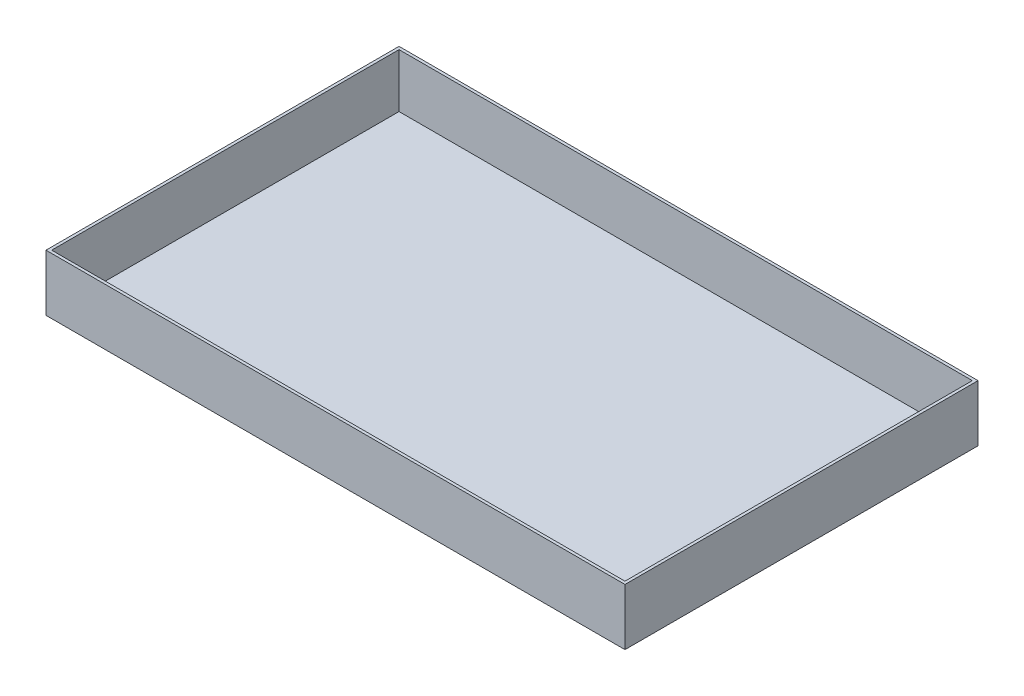
ISO-10303-21;
HEADER;
FILE_DESCRIPTION(('STEP AP214'),'2;1');
FILE_NAME('part.step','',(''),(''),'','','');
FILE_SCHEMA(('AUTOMOTIVE_DESIGN { 1 0 10303 214 1 1 1 1 }'));
ENDSEC;
DATA;
#1=APPLICATION_CONTEXT('core data for automotive mechanical design processes');
#2=APPLICATION_PROTOCOL_DEFINITION('international standard','automotive_design',2000,#1);
#3=PRODUCT_CONTEXT('',#1,'mechanical');
#4=PRODUCT('Part','Part','',(#3));
#5=PRODUCT_RELATED_PRODUCT_CATEGORY('part','',(#4));
#6=PRODUCT_DEFINITION_FORMATION('','',#4);
#7=PRODUCT_DEFINITION_CONTEXT('part definition',#1,'design');
#8=PRODUCT_DEFINITION('design','',#6,#7);
#9=PRODUCT_DEFINITION_SHAPE('','',#8);
#10=(LENGTH_UNIT() NAMED_UNIT(*) SI_UNIT(.MILLI.,.METRE.));
#11=(NAMED_UNIT(*) PLANE_ANGLE_UNIT() SI_UNIT($,.RADIAN.));
#12=(NAMED_UNIT(*) SI_UNIT($,.STERADIAN.) SOLID_ANGLE_UNIT());
#13=UNCERTAINTY_MEASURE_WITH_UNIT(LENGTH_MEASURE(1.E-05),#10,'distance_accuracy_value','');
#14=(GEOMETRIC_REPRESENTATION_CONTEXT(3) GLOBAL_UNCERTAINTY_ASSIGNED_CONTEXT((#13)) GLOBAL_UNIT_ASSIGNED_CONTEXT((#10,
#11,#12)) REPRESENTATION_CONTEXT('',''));
#15=CARTESIAN_POINT('',(0.,0.,0.));
#16=DIRECTION('',(0.,0.,1.));
#17=DIRECTION('',(1.,0.,0.));
#18=AXIS2_PLACEMENT_3D('',#15,#16,#17);
#19=CARTESIAN_POINT('',(0.,40.,0.));
#20=DIRECTION('',(0.,-1.,0.));
#21=DIRECTION('',(0.,0.,-1.));
#22=AXIS2_PLACEMENT_3D('',#19,#20,#21);
#23=PLANE('',#22);
#24=DIRECTION('',(0.,0.,1.));
#25=VECTOR('',#24,1.);
#26=CARTESIAN_POINT('',(0.,40.,0.));
#27=LINE('',#26,#25);
#28=CARTESIAN_POINT('',(0.,40.,-250.));
#29=VERTEX_POINT('',#28);
#30=CARTESIAN_POINT('',(0.,40.,0.));
#31=VERTEX_POINT('',#30);
#32=EDGE_CURVE('E142',#29,#31,#27,.T.);
#33=ORIENTED_EDGE('',*,*,#32,.T.);
#34=DIRECTION('',(1.,0.,0.));
#35=VECTOR('',#34,1.);
#36=CARTESIAN_POINT('',(0.,40.,0.));
#37=LINE('',#36,#35);
#38=CARTESIAN_POINT('',(410.,40.,0.));
#39=VERTEX_POINT('',#38);
#40=EDGE_CURVE('E86',#31,#39,#37,.T.);
#41=ORIENTED_EDGE('',*,*,#40,.T.);
#42=DIRECTION('',(0.,0.,-1.));
#43=VECTOR('',#42,1.);
#44=CARTESIAN_POINT('',(410.,40.,0.));
#45=LINE('',#44,#43);
#46=CARTESIAN_POINT('',(410.,40.,-250.));
#47=VERTEX_POINT('',#46);
#48=EDGE_CURVE('E145',#39,#47,#45,.T.);
#49=ORIENTED_EDGE('',*,*,#48,.T.);
#50=DIRECTION('',(-1.,0.,0.));
#51=VECTOR('',#50,1.);
#52=CARTESIAN_POINT('',(0.,40.,-250.));
#53=LINE('',#52,#51);
#54=EDGE_CURVE('E58',#47,#29,#53,.T.);
#55=ORIENTED_EDGE('',*,*,#54,.T.);
#56=EDGE_LOOP('',(#33,#41,#49,#55));
#57=FACE_BOUND('',#56,.T.);
#58=DIRECTION('',(0.,0.,1.));
#59=VECTOR('',#58,1.);
#60=CARTESIAN_POINT('',(2.,40.,0.));
#61=LINE('',#60,#59);
#62=CARTESIAN_POINT('',(2.,40.,-248.));
#63=VERTEX_POINT('',#62);
#64=CARTESIAN_POINT('',(2.,40.,-2.));
#65=VERTEX_POINT('',#64);
#66=EDGE_CURVE('E131',#63,#65,#61,.T.);
#67=ORIENTED_EDGE('',*,*,#66,.F.);
#68=DIRECTION('',(-1.,0.,0.));
#69=VECTOR('',#68,1.);
#70=CARTESIAN_POINT('',(0.,40.,-248.));
#71=LINE('',#70,#69);
#72=CARTESIAN_POINT('',(408.,40.,-248.));
#73=VERTEX_POINT('',#72);
#74=EDGE_CURVE('E140',#73,#63,#71,.T.);
#75=ORIENTED_EDGE('',*,*,#74,.F.);
#76=DIRECTION('',(0.,0.,-1.));
#77=VECTOR('',#76,1.);
#78=CARTESIAN_POINT('',(408.,40.,0.));
#79=LINE('',#78,#77);
#80=CARTESIAN_POINT('',(408.,40.,-2.));
#81=VERTEX_POINT('',#80);
#82=EDGE_CURVE('E138',#81,#73,#79,.T.);
#83=ORIENTED_EDGE('',*,*,#82,.F.);
#84=DIRECTION('',(1.,0.,0.));
#85=VECTOR('',#84,1.);
#86=CARTESIAN_POINT('',(0.,40.,-2.));
#87=LINE('',#86,#85);
#88=EDGE_CURVE('E123',#65,#81,#87,.T.);
#89=ORIENTED_EDGE('',*,*,#88,.F.);
#90=EDGE_LOOP('',(#67,#75,#83,#89));
#91=FACE_BOUND('',#90,.T.);
#92=ADVANCED_FACE('F34',(#57,#91),#23,.F.);
#93=CARTESIAN_POINT('',(0.,40.,0.));
#94=DIRECTION('',(1.,0.,0.));
#95=DIRECTION('',(0.,0.,-1.));
#96=AXIS2_PLACEMENT_3D('',#93,#94,#95);
#97=PLANE('',#96);
#98=DIRECTION('',(0.,0.,1.));
#99=VECTOR('',#98,1.);
#100=CARTESIAN_POINT('',(0.,0.,0.));
#101=LINE('',#100,#99);
#102=CARTESIAN_POINT('',(0.,0.,-250.));
#103=VERTEX_POINT('',#102);
#104=CARTESIAN_POINT('',(0.,0.,0.));
#105=VERTEX_POINT('',#104);
#106=EDGE_CURVE('E149',#103,#105,#101,.T.);
#107=ORIENTED_EDGE('',*,*,#106,.T.);
#108=DIRECTION('',(0.,-1.,0.));
#109=VECTOR('',#108,1.);
#110=CARTESIAN_POINT('',(0.,40.,0.));
#111=LINE('',#110,#109);
#112=EDGE_CURVE('E11',#31,#105,#111,.T.);
#113=ORIENTED_EDGE('',*,*,#112,.F.);
#114=ORIENTED_EDGE('',*,*,#32,.F.);
#115=DIRECTION('',(0.,-1.,0.));
#116=VECTOR('',#115,1.);
#117=CARTESIAN_POINT('',(0.,40.,-250.));
#118=LINE('',#117,#116);
#119=EDGE_CURVE('E148',#29,#103,#118,.T.);
#120=ORIENTED_EDGE('',*,*,#119,.T.);
#121=EDGE_LOOP('',(#107,#113,#114,#120));
#122=FACE_BOUND('',#121,.T.);
#123=ADVANCED_FACE('F36',(#122),#97,.F.);
#124=CARTESIAN_POINT('',(0.,40.,0.));
#125=DIRECTION('',(0.,0.,-1.));
#126=DIRECTION('',(-1.,0.,0.));
#127=AXIS2_PLACEMENT_3D('',#124,#125,#126);
#128=PLANE('',#127);
#129=DIRECTION('',(1.,0.,0.));
#130=VECTOR('',#129,1.);
#131=CARTESIAN_POINT('',(0.,0.,0.));
#132=LINE('',#131,#130);
#133=CARTESIAN_POINT('',(410.,0.,0.));
#134=VERTEX_POINT('',#133);
#135=EDGE_CURVE('E152',#105,#134,#132,.T.);
#136=ORIENTED_EDGE('',*,*,#135,.T.);
#137=DIRECTION('',(0.,-1.,0.));
#138=VECTOR('',#137,1.);
#139=CARTESIAN_POINT('',(410.,40.,0.));
#140=LINE('',#139,#138);
#141=EDGE_CURVE('E42',#39,#134,#140,.T.);
#142=ORIENTED_EDGE('',*,*,#141,.F.);
#143=ORIENTED_EDGE('',*,*,#40,.F.);
#144=ORIENTED_EDGE('',*,*,#112,.T.);
#145=EDGE_LOOP('',(#136,#142,#143,#144));
#146=FACE_BOUND('',#145,.T.);
#147=ADVANCED_FACE('F180',(#146),#128,.F.);
#148=CARTESIAN_POINT('',(410.,40.,0.));
#149=DIRECTION('',(-1.,0.,0.));
#150=DIRECTION('',(0.,0.,1.));
#151=AXIS2_PLACEMENT_3D('',#148,#149,#150);
#152=PLANE('',#151);
#153=DIRECTION('',(0.,0.,-1.));
#154=VECTOR('',#153,1.);
#155=CARTESIAN_POINT('',(410.,0.,0.));
#156=LINE('',#155,#154);
#157=CARTESIAN_POINT('',(410.,0.,-250.));
#158=VERTEX_POINT('',#157);
#159=EDGE_CURVE('E154',#134,#158,#156,.T.);
#160=ORIENTED_EDGE('',*,*,#159,.T.);
#161=DIRECTION('',(0.,-1.,0.));
#162=VECTOR('',#161,1.);
#163=CARTESIAN_POINT('',(410.,40.,-250.));
#164=LINE('',#163,#162);
#165=EDGE_CURVE('E158',#47,#158,#164,.T.);
#166=ORIENTED_EDGE('',*,*,#165,.F.);
#167=ORIENTED_EDGE('',*,*,#48,.F.);
#168=ORIENTED_EDGE('',*,*,#141,.T.);
#169=EDGE_LOOP('',(#160,#166,#167,#168));
#170=FACE_BOUND('',#169,.T.);
#171=ADVANCED_FACE('F163',(#170),#152,.F.);
#172=CARTESIAN_POINT('',(0.,40.,-250.));
#173=DIRECTION('',(0.,0.,1.));
#174=DIRECTION('',(1.,0.,0.));
#175=AXIS2_PLACEMENT_3D('',#172,#173,#174);
#176=PLANE('',#175);
#177=DIRECTION('',(-1.,0.,0.));
#178=VECTOR('',#177,1.);
#179=CARTESIAN_POINT('',(0.,0.,-250.));
#180=LINE('',#179,#178);
#181=EDGE_CURVE('E79',#158,#103,#180,.T.);
#182=ORIENTED_EDGE('',*,*,#181,.T.);
#183=ORIENTED_EDGE('',*,*,#119,.F.);
#184=ORIENTED_EDGE('',*,*,#54,.F.);
#185=ORIENTED_EDGE('',*,*,#165,.T.);
#186=EDGE_LOOP('',(#182,#183,#184,#185));
#187=FACE_BOUND('',#186,.T.);
#188=ADVANCED_FACE('F171',(#187),#176,.F.);
#189=CARTESIAN_POINT('',(0.,0.,0.));
#190=DIRECTION('',(0.,-1.,0.));
#191=DIRECTION('',(0.,0.,-1.));
#192=AXIS2_PLACEMENT_3D('',#189,#190,#191);
#193=PLANE('',#192);
#194=ORIENTED_EDGE('',*,*,#106,.F.);
#195=ORIENTED_EDGE('',*,*,#181,.F.);
#196=ORIENTED_EDGE('',*,*,#159,.F.);
#197=ORIENTED_EDGE('',*,*,#135,.F.);
#198=EDGE_LOOP('',(#194,#195,#196,#197));
#199=FACE_BOUND('',#198,.T.);
#200=ADVANCED_FACE('F167',(#199),#193,.T.);
#201=CARTESIAN_POINT('',(2.,40.,0.));
#202=DIRECTION('',(1.,0.,0.));
#203=DIRECTION('',(0.,0.,-1.));
#204=AXIS2_PLACEMENT_3D('',#201,#202,#203);
#205=PLANE('',#204);
#206=DIRECTION('',(0.,0.,1.));
#207=VECTOR('',#206,1.);
#208=CARTESIAN_POINT('',(2.,2.,0.));
#209=LINE('',#208,#207);
#210=CARTESIAN_POINT('',(2.,2.,-248.));
#211=VERTEX_POINT('',#210);
#212=CARTESIAN_POINT('',(2.,2.,-2.));
#213=VERTEX_POINT('',#212);
#214=EDGE_CURVE('E114',#211,#213,#209,.T.);
#215=ORIENTED_EDGE('',*,*,#214,.F.);
#216=DIRECTION('',(0.,-1.,0.));
#217=VECTOR('',#216,1.);
#218=CARTESIAN_POINT('',(2.,40.,-248.));
#219=LINE('',#218,#217);
#220=EDGE_CURVE('E134',#63,#211,#219,.T.);
#221=ORIENTED_EDGE('',*,*,#220,.F.);
#222=ORIENTED_EDGE('',*,*,#66,.T.);
#223=DIRECTION('',(0.,-1.,0.));
#224=VECTOR('',#223,1.);
#225=CARTESIAN_POINT('',(2.,40.,-2.));
#226=LINE('',#225,#224);
#227=EDGE_CURVE('E126',#65,#213,#226,.T.);
#228=ORIENTED_EDGE('',*,*,#227,.T.);
#229=EDGE_LOOP('',(#215,#221,#222,#228));
#230=FACE_BOUND('',#229,.T.);
#231=ADVANCED_FACE('F178',(#230),#205,.T.);
#232=CARTESIAN_POINT('',(0.,40.,-2.));
#233=DIRECTION('',(0.,0.,-1.));
#234=DIRECTION('',(-1.,0.,0.));
#235=AXIS2_PLACEMENT_3D('',#232,#233,#234);
#236=PLANE('',#235);
#237=DIRECTION('',(1.,0.,0.));
#238=VECTOR('',#237,1.);
#239=CARTESIAN_POINT('',(0.,2.,-2.));
#240=LINE('',#239,#238);
#241=CARTESIAN_POINT('',(408.,2.,-2.));
#242=VERTEX_POINT('',#241);
#243=EDGE_CURVE('E108',#213,#242,#240,.T.);
#244=ORIENTED_EDGE('',*,*,#243,.F.);
#245=ORIENTED_EDGE('',*,*,#227,.F.);
#246=ORIENTED_EDGE('',*,*,#88,.T.);
#247=DIRECTION('',(0.,-1.,0.));
#248=VECTOR('',#247,1.);
#249=CARTESIAN_POINT('',(408.,40.,-2.));
#250=LINE('',#249,#248);
#251=EDGE_CURVE('E120',#81,#242,#250,.T.);
#252=ORIENTED_EDGE('',*,*,#251,.T.);
#253=EDGE_LOOP('',(#244,#245,#246,#252));
#254=FACE_BOUND('',#253,.T.);
#255=ADVANCED_FACE('F121',(#254),#236,.T.);
#256=CARTESIAN_POINT('',(408.,40.,0.));
#257=DIRECTION('',(-1.,0.,0.));
#258=DIRECTION('',(0.,0.,1.));
#259=AXIS2_PLACEMENT_3D('',#256,#257,#258);
#260=PLANE('',#259);
#261=DIRECTION('',(0.,0.,-1.));
#262=VECTOR('',#261,1.);
#263=CARTESIAN_POINT('',(408.,2.,0.));
#264=LINE('',#263,#262);
#265=CARTESIAN_POINT('',(408.,2.,-248.));
#266=VERTEX_POINT('',#265);
#267=EDGE_CURVE('E112',#242,#266,#264,.T.);
#268=ORIENTED_EDGE('',*,*,#267,.F.);
#269=ORIENTED_EDGE('',*,*,#251,.F.);
#270=ORIENTED_EDGE('',*,*,#82,.T.);
#271=DIRECTION('',(0.,-1.,0.));
#272=VECTOR('',#271,1.);
#273=CARTESIAN_POINT('',(408.,40.,-248.));
#274=LINE('',#273,#272);
#275=EDGE_CURVE('E49',#73,#266,#274,.T.);
#276=ORIENTED_EDGE('',*,*,#275,.T.);
#277=EDGE_LOOP('',(#268,#269,#270,#276));
#278=FACE_BOUND('',#277,.T.);
#279=ADVANCED_FACE('F128',(#278),#260,.T.);
#280=CARTESIAN_POINT('',(0.,40.,-248.));
#281=DIRECTION('',(0.,0.,1.));
#282=DIRECTION('',(1.,0.,0.));
#283=AXIS2_PLACEMENT_3D('',#280,#281,#282);
#284=PLANE('',#283);
#285=DIRECTION('',(-1.,0.,0.));
#286=VECTOR('',#285,1.);
#287=CARTESIAN_POINT('',(0.,2.,-248.));
#288=LINE('',#287,#286);
#289=EDGE_CURVE('E129',#266,#211,#288,.T.);
#290=ORIENTED_EDGE('',*,*,#289,.F.);
#291=ORIENTED_EDGE('',*,*,#275,.F.);
#292=ORIENTED_EDGE('',*,*,#74,.T.);
#293=ORIENTED_EDGE('',*,*,#220,.T.);
#294=EDGE_LOOP('',(#290,#291,#292,#293));
#295=FACE_BOUND('',#294,.T.);
#296=ADVANCED_FACE('F191',(#295),#284,.T.);
#297=CARTESIAN_POINT('',(0.,2.,0.));
#298=DIRECTION('',(0.,-1.,0.));
#299=DIRECTION('',(0.,0.,-1.));
#300=AXIS2_PLACEMENT_3D('',#297,#298,#299);
#301=PLANE('',#300);
#302=ORIENTED_EDGE('',*,*,#214,.T.);
#303=ORIENTED_EDGE('',*,*,#243,.T.);
#304=ORIENTED_EDGE('',*,*,#267,.T.);
#305=ORIENTED_EDGE('',*,*,#289,.T.);
#306=EDGE_LOOP('',(#302,#303,#304,#305));
#307=FACE_BOUND('',#306,.T.);
#308=ADVANCED_FACE('F110',(#307),#301,.F.);
#309=CLOSED_SHELL('',(#92,#123,#147,#171,#188,#200,#231,#255,#279,#296,#308));
#310=MANIFOLD_SOLID_BREP('B2',#309);
#311=ADVANCED_BREP_SHAPE_REPRESENTATION('',(#18,#310),#14);
#312=SHAPE_DEFINITION_REPRESENTATION(#9,#311);
ENDSEC;
END-ISO-10303-21;
